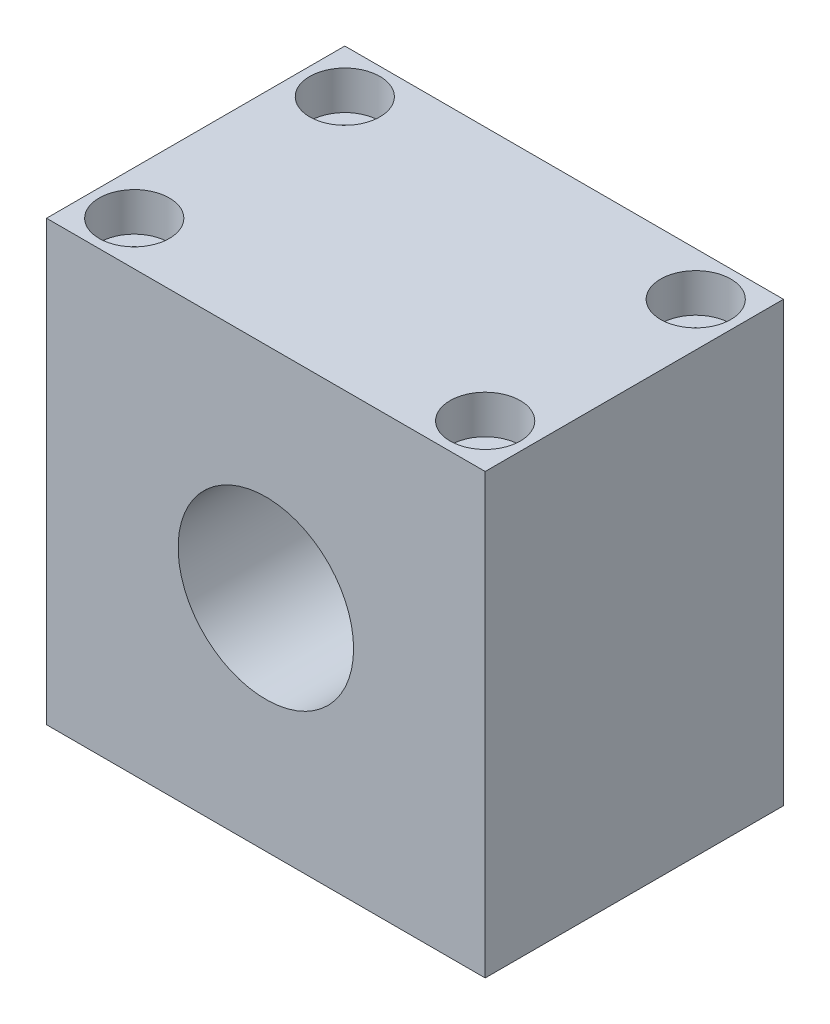
ISO-10303-21;
HEADER;
FILE_DESCRIPTION(('STEP AP214'),'2;1');
FILE_NAME('part.step','',(''),(''),'','','');
FILE_SCHEMA(('AUTOMOTIVE_DESIGN { 1 0 10303 214 1 1 1 1 }'));
ENDSEC;
DATA;
#1=APPLICATION_CONTEXT('core data for automotive mechanical design processes');
#2=APPLICATION_PROTOCOL_DEFINITION('international standard','automotive_design',2000,#1);
#3=PRODUCT_CONTEXT('',#1,'mechanical');
#4=PRODUCT('Part','Part','',(#3));
#5=PRODUCT_RELATED_PRODUCT_CATEGORY('part','',(#4));
#6=PRODUCT_DEFINITION_FORMATION('','',#4);
#7=PRODUCT_DEFINITION_CONTEXT('part definition',#1,'design');
#8=PRODUCT_DEFINITION('design','',#6,#7);
#9=PRODUCT_DEFINITION_SHAPE('','',#8);
#10=(LENGTH_UNIT() NAMED_UNIT(*) SI_UNIT(.MILLI.,.METRE.));
#11=(NAMED_UNIT(*) PLANE_ANGLE_UNIT() SI_UNIT($,.RADIAN.));
#12=(NAMED_UNIT(*) SI_UNIT($,.STERADIAN.) SOLID_ANGLE_UNIT());
#13=UNCERTAINTY_MEASURE_WITH_UNIT(LENGTH_MEASURE(1.E-05),#10,'distance_accuracy_value','');
#14=(GEOMETRIC_REPRESENTATION_CONTEXT(3) GLOBAL_UNCERTAINTY_ASSIGNED_CONTEXT((#13)) GLOBAL_UNIT_ASSIGNED_CONTEXT((#10,
#11,#12)) REPRESENTATION_CONTEXT('',''));
#15=CARTESIAN_POINT('',(0.,0.,0.));
#16=DIRECTION('',(0.,0.,1.));
#17=DIRECTION('',(1.,0.,0.));
#18=AXIS2_PLACEMENT_3D('',#15,#16,#17);
#19=CARTESIAN_POINT('',(25.,-25.,34.));
#20=DIRECTION('',(-1.,0.,0.));
#21=DIRECTION('',(0.,0.,1.));
#22=AXIS2_PLACEMENT_3D('',#19,#20,#21);
#23=PLANE('',#22);
#24=DIRECTION('',(0.,1.,0.));
#25=VECTOR('',#24,1.);
#26=CARTESIAN_POINT('',(25.,-25.,0.));
#27=LINE('',#26,#25);
#28=CARTESIAN_POINT('',(25.,-25.,0.));
#29=VERTEX_POINT('',#28);
#30=CARTESIAN_POINT('',(25.,25.,0.));
#31=VERTEX_POINT('',#30);
#32=EDGE_CURVE('E100',#29,#31,#27,.T.);
#33=ORIENTED_EDGE('',*,*,#32,.T.);
#34=DIRECTION('',(0.,0.,-1.));
#35=VECTOR('',#34,1.);
#36=CARTESIAN_POINT('',(25.,25.,34.));
#37=LINE('',#36,#35);
#38=CARTESIAN_POINT('',(25.,25.,34.));
#39=VERTEX_POINT('',#38);
#40=EDGE_CURVE('E11',#39,#31,#37,.T.);
#41=ORIENTED_EDGE('',*,*,#40,.F.);
#42=DIRECTION('',(0.,1.,0.));
#43=VECTOR('',#42,1.);
#44=CARTESIAN_POINT('',(25.,-25.,34.));
#45=LINE('',#44,#43);
#46=CARTESIAN_POINT('',(25.,-25.,34.));
#47=VERTEX_POINT('',#46);
#48=EDGE_CURVE('E88',#47,#39,#45,.T.);
#49=ORIENTED_EDGE('',*,*,#48,.F.);
#50=DIRECTION('',(0.,0.,-1.));
#51=VECTOR('',#50,1.);
#52=CARTESIAN_POINT('',(25.,-25.,34.));
#53=LINE('',#52,#51);
#54=EDGE_CURVE('E96',#47,#29,#53,.T.);
#55=ORIENTED_EDGE('',*,*,#54,.T.);
#56=EDGE_LOOP('',(#33,#41,#49,#55));
#57=FACE_BOUND('',#56,.T.);
#58=ADVANCED_FACE('F37',(#57),#23,.F.);
#59=CARTESIAN_POINT('',(-25.,25.,34.));
#60=DIRECTION('',(0.,-1.,0.));
#61=DIRECTION('',(0.,0.,-1.));
#62=AXIS2_PLACEMENT_3D('',#59,#60,#61);
#63=PLANE('',#62);
#64=CARTESIAN_POINT('',(-20.,25.,5.));
#65=DIRECTION('',(0.,1.,0.));
#66=DIRECTION('',(0.,0.,1.));
#67=AXIS2_PLACEMENT_3D('',#64,#65,#66);
#68=CIRCLE('',#67,3.99999999999999);
#69=CARTESIAN_POINT('',(-20.,25.,8.99999999999999));
#70=VERTEX_POINT('',#69);
#71=EDGE_CURVE('E158',#70,#70,#68,.T.);
#72=ORIENTED_EDGE('',*,*,#71,.F.);
#73=EDGE_LOOP('',(#72));
#74=FACE_BOUND('',#73,.T.);
#75=CARTESIAN_POINT('',(20.,25.,5.));
#76=DIRECTION('',(0.,1.,0.));
#77=DIRECTION('',(0.,0.,1.));
#78=AXIS2_PLACEMENT_3D('',#75,#76,#77);
#79=CIRCLE('',#78,3.99999999999999);
#80=CARTESIAN_POINT('',(20.,25.,8.99999999999999));
#81=VERTEX_POINT('',#80);
#82=EDGE_CURVE('E146',#81,#81,#79,.T.);
#83=ORIENTED_EDGE('',*,*,#82,.F.);
#84=EDGE_LOOP('',(#83));
#85=FACE_BOUND('',#84,.T.);
#86=CARTESIAN_POINT('',(20.,25.,29.));
#87=DIRECTION('',(0.,1.,0.));
#88=DIRECTION('',(0.,0.,1.));
#89=AXIS2_PLACEMENT_3D('',#86,#87,#88);
#90=CIRCLE('',#89,3.99999999999999);
#91=CARTESIAN_POINT('',(20.,25.,33.));
#92=VERTEX_POINT('',#91);
#93=EDGE_CURVE('E134',#92,#92,#90,.T.);
#94=ORIENTED_EDGE('',*,*,#93,.F.);
#95=EDGE_LOOP('',(#94));
#96=FACE_BOUND('',#95,.T.);
#97=CARTESIAN_POINT('',(-20.,25.,29.));
#98=DIRECTION('',(0.,1.,0.));
#99=DIRECTION('',(0.,0.,1.));
#100=AXIS2_PLACEMENT_3D('',#97,#98,#99);
#101=CIRCLE('',#100,3.99999999999999);
#102=CARTESIAN_POINT('',(-20.,25.,33.));
#103=VERTEX_POINT('',#102);
#104=EDGE_CURVE('E122',#103,#103,#101,.T.);
#105=ORIENTED_EDGE('',*,*,#104,.F.);
#106=EDGE_LOOP('',(#105));
#107=FACE_BOUND('',#106,.T.);
#108=DIRECTION('',(-1.,0.,0.));
#109=VECTOR('',#108,1.);
#110=CARTESIAN_POINT('',(-25.,25.,0.));
#111=LINE('',#110,#109);
#112=CARTESIAN_POINT('',(-25.,25.,0.));
#113=VERTEX_POINT('',#112);
#114=EDGE_CURVE('E92',#31,#113,#111,.T.);
#115=ORIENTED_EDGE('',*,*,#114,.T.);
#116=DIRECTION('',(0.,0.,-1.));
#117=VECTOR('',#116,1.);
#118=CARTESIAN_POINT('',(-25.,25.,34.));
#119=LINE('',#118,#117);
#120=CARTESIAN_POINT('',(-25.,25.,34.));
#121=VERTEX_POINT('',#120);
#122=EDGE_CURVE('E45',#121,#113,#119,.T.);
#123=ORIENTED_EDGE('',*,*,#122,.F.);
#124=DIRECTION('',(-1.,0.,0.));
#125=VECTOR('',#124,1.);
#126=CARTESIAN_POINT('',(-25.,25.,34.));
#127=LINE('',#126,#125);
#128=EDGE_CURVE('E83',#39,#121,#127,.T.);
#129=ORIENTED_EDGE('',*,*,#128,.F.);
#130=ORIENTED_EDGE('',*,*,#40,.T.);
#131=EDGE_LOOP('',(#115,#123,#129,#130));
#132=FACE_BOUND('',#131,.T.);
#133=ADVANCED_FACE('F91',(#74,#85,#96,#107,#132),#63,.F.);
#134=CARTESIAN_POINT('',(-25.,-25.,34.));
#135=DIRECTION('',(1.,0.,0.));
#136=DIRECTION('',(0.,0.,-1.));
#137=AXIS2_PLACEMENT_3D('',#134,#135,#136);
#138=PLANE('',#137);
#139=DIRECTION('',(0.,-1.,0.));
#140=VECTOR('',#139,1.);
#141=CARTESIAN_POINT('',(-25.,-25.,0.));
#142=LINE('',#141,#140);
#143=CARTESIAN_POINT('',(-25.,-25.,0.));
#144=VERTEX_POINT('',#143);
#145=EDGE_CURVE('E70',#113,#144,#142,.T.);
#146=ORIENTED_EDGE('',*,*,#145,.T.);
#147=DIRECTION('',(0.,0.,-1.));
#148=VECTOR('',#147,1.);
#149=CARTESIAN_POINT('',(-25.,-25.,34.));
#150=LINE('',#149,#148);
#151=CARTESIAN_POINT('',(-25.,-25.,34.));
#152=VERTEX_POINT('',#151);
#153=EDGE_CURVE('E93',#152,#144,#150,.T.);
#154=ORIENTED_EDGE('',*,*,#153,.F.);
#155=DIRECTION('',(0.,-1.,0.));
#156=VECTOR('',#155,1.);
#157=CARTESIAN_POINT('',(-25.,-25.,34.));
#158=LINE('',#157,#156);
#159=EDGE_CURVE('E86',#121,#152,#158,.T.);
#160=ORIENTED_EDGE('',*,*,#159,.F.);
#161=ORIENTED_EDGE('',*,*,#122,.T.);
#162=EDGE_LOOP('',(#146,#154,#160,#161));
#163=FACE_BOUND('',#162,.T.);
#164=ADVANCED_FACE('F94',(#163),#138,.F.);
#165=CARTESIAN_POINT('',(-25.,-25.,34.));
#166=DIRECTION('',(0.,1.,0.));
#167=DIRECTION('',(0.,0.,1.));
#168=AXIS2_PLACEMENT_3D('',#165,#166,#167);
#169=PLANE('',#168);
#170=CARTESIAN_POINT('',(-20.,-25.,5.));
#171=DIRECTION('',(0.,1.,0.));
#172=DIRECTION('',(0.,0.,1.));
#173=AXIS2_PLACEMENT_3D('',#170,#171,#172);
#174=CIRCLE('',#173,2.24999999999999);
#175=CARTESIAN_POINT('',(-20.,-25.,7.24999999999999));
#176=VERTEX_POINT('',#175);
#177=EDGE_CURVE('E149',#176,#176,#174,.T.);
#178=ORIENTED_EDGE('',*,*,#177,.T.);
#179=EDGE_LOOP('',(#178));
#180=FACE_BOUND('',#179,.T.);
#181=CARTESIAN_POINT('',(20.,-25.,5.));
#182=DIRECTION('',(0.,1.,0.));
#183=DIRECTION('',(0.,0.,1.));
#184=AXIS2_PLACEMENT_3D('',#181,#182,#183);
#185=CIRCLE('',#184,2.24999999999999);
#186=CARTESIAN_POINT('',(20.,-25.,7.24999999999999));
#187=VERTEX_POINT('',#186);
#188=EDGE_CURVE('E137',#187,#187,#185,.T.);
#189=ORIENTED_EDGE('',*,*,#188,.T.);
#190=EDGE_LOOP('',(#189));
#191=FACE_BOUND('',#190,.T.);
#192=CARTESIAN_POINT('',(20.,-25.,29.));
#193=DIRECTION('',(0.,1.,0.));
#194=DIRECTION('',(0.,0.,1.));
#195=AXIS2_PLACEMENT_3D('',#192,#193,#194);
#196=CIRCLE('',#195,2.24999999999999);
#197=CARTESIAN_POINT('',(20.,-25.,31.25));
#198=VERTEX_POINT('',#197);
#199=EDGE_CURVE('E125',#198,#198,#196,.T.);
#200=ORIENTED_EDGE('',*,*,#199,.T.);
#201=EDGE_LOOP('',(#200));
#202=FACE_BOUND('',#201,.T.);
#203=CARTESIAN_POINT('',(-20.,-25.,29.));
#204=DIRECTION('',(0.,1.,0.));
#205=DIRECTION('',(0.,0.,1.));
#206=AXIS2_PLACEMENT_3D('',#203,#204,#205);
#207=CIRCLE('',#206,2.24999999999999);
#208=CARTESIAN_POINT('',(-20.,-25.,31.25));
#209=VERTEX_POINT('',#208);
#210=EDGE_CURVE('E103',#209,#209,#207,.T.);
#211=ORIENTED_EDGE('',*,*,#210,.T.);
#212=EDGE_LOOP('',(#211));
#213=FACE_BOUND('',#212,.T.);
#214=DIRECTION('',(1.,0.,0.));
#215=VECTOR('',#214,1.);
#216=CARTESIAN_POINT('',(-25.,-25.,0.));
#217=LINE('',#216,#215);
#218=EDGE_CURVE('E76',#144,#29,#217,.T.);
#219=ORIENTED_EDGE('',*,*,#218,.T.);
#220=ORIENTED_EDGE('',*,*,#54,.F.);
#221=DIRECTION('',(1.,0.,0.));
#222=VECTOR('',#221,1.);
#223=CARTESIAN_POINT('',(-25.,-25.,34.));
#224=LINE('',#223,#222);
#225=EDGE_CURVE('E53',#152,#47,#224,.T.);
#226=ORIENTED_EDGE('',*,*,#225,.F.);
#227=ORIENTED_EDGE('',*,*,#153,.T.);
#228=EDGE_LOOP('',(#219,#220,#226,#227));
#229=FACE_BOUND('',#228,.T.);
#230=ADVANCED_FACE('F108',(#180,#191,#202,#213,#229),#169,.F.);
#231=CARTESIAN_POINT('',(0.,0.,34.));
#232=DIRECTION('',(0.,0.,-1.));
#233=DIRECTION('',(-1.,0.,0.));
#234=AXIS2_PLACEMENT_3D('',#231,#232,#233);
#235=PLANE('',#234);
#236=CARTESIAN_POINT('',(0.,0.,34.));
#237=DIRECTION('',(0.,0.,1.));
#238=DIRECTION('',(1.,0.,0.));
#239=AXIS2_PLACEMENT_3D('',#236,#237,#238);
#240=CIRCLE('',#239,10.);
#241=CARTESIAN_POINT('',(10.,0.,34.));
#242=VERTEX_POINT('',#241);
#243=EDGE_CURVE('E162',#242,#242,#240,.T.);
#244=ORIENTED_EDGE('',*,*,#243,.F.);
#245=EDGE_LOOP('',(#244));
#246=FACE_BOUND('',#245,.T.);
#247=ORIENTED_EDGE('',*,*,#48,.T.);
#248=ORIENTED_EDGE('',*,*,#128,.T.);
#249=ORIENTED_EDGE('',*,*,#159,.T.);
#250=ORIENTED_EDGE('',*,*,#225,.T.);
#251=EDGE_LOOP('',(#247,#248,#249,#250));
#252=FACE_BOUND('',#251,.T.);
#253=ADVANCED_FACE('F84',(#246,#252),#235,.F.);
#254=CARTESIAN_POINT('',(0.,0.,0.));
#255=DIRECTION('',(0.,0.,-1.));
#256=DIRECTION('',(-1.,0.,0.));
#257=AXIS2_PLACEMENT_3D('',#254,#255,#256);
#258=PLANE('',#257);
#259=CARTESIAN_POINT('',(0.,0.,0.));
#260=DIRECTION('',(0.,0.,1.));
#261=DIRECTION('',(1.,0.,0.));
#262=AXIS2_PLACEMENT_3D('',#259,#260,#261);
#263=CIRCLE('',#262,10.);
#264=CARTESIAN_POINT('',(10.,0.,0.));
#265=VERTEX_POINT('',#264);
#266=EDGE_CURVE('E161',#265,#265,#263,.T.);
#267=ORIENTED_EDGE('',*,*,#266,.T.);
#268=EDGE_LOOP('',(#267));
#269=FACE_BOUND('',#268,.T.);
#270=ORIENTED_EDGE('',*,*,#32,.F.);
#271=ORIENTED_EDGE('',*,*,#218,.F.);
#272=ORIENTED_EDGE('',*,*,#145,.F.);
#273=ORIENTED_EDGE('',*,*,#114,.F.);
#274=EDGE_LOOP('',(#270,#271,#272,#273));
#275=FACE_BOUND('',#274,.T.);
#276=ADVANCED_FACE('F111',(#269,#275),#258,.T.);
#277=CARTESIAN_POINT('',(-20.,25.,29.));
#278=DIRECTION('',(0.,1.,0.));
#279=DIRECTION('',(0.,0.,1.));
#280=AXIS2_PLACEMENT_3D('',#277,#278,#279);
#281=CYLINDRICAL_SURFACE('',#280,2.25);
#282=ORIENTED_EDGE('',*,*,#210,.F.);
#283=EDGE_LOOP('',(#282));
#284=FACE_BOUND('',#283,.T.);
#285=CARTESIAN_POINT('',(-20.,20.6,29.));
#286=DIRECTION('',(0.,1.,0.));
#287=DIRECTION('',(0.,0.,1.));
#288=AXIS2_PLACEMENT_3D('',#285,#286,#287);
#289=CIRCLE('',#288,2.25000000000001);
#290=CARTESIAN_POINT('',(-20.,20.6,31.25));
#291=VERTEX_POINT('',#290);
#292=EDGE_CURVE('E116',#291,#291,#289,.T.);
#293=ORIENTED_EDGE('',*,*,#292,.T.);
#294=EDGE_LOOP('',(#293));
#295=FACE_BOUND('',#294,.T.);
#296=ADVANCED_FACE('F182',(#284,#295),#281,.F.);
#297=CARTESIAN_POINT('',(-17.75,20.6,29.));
#298=DIRECTION('',(0.,-1.,0.));
#299=DIRECTION('',(0.,0.,-1.));
#300=AXIS2_PLACEMENT_3D('',#297,#298,#299);
#301=PLANE('',#300);
#302=ORIENTED_EDGE('',*,*,#292,.F.);
#303=EDGE_LOOP('',(#302));
#304=FACE_BOUND('',#303,.T.);
#305=CARTESIAN_POINT('',(-20.,20.6,29.));
#306=DIRECTION('',(0.,1.,0.));
#307=DIRECTION('',(0.,0.,1.));
#308=AXIS2_PLACEMENT_3D('',#305,#306,#307);
#309=CIRCLE('',#308,4.);
#310=CARTESIAN_POINT('',(-20.,20.6,33.));
#311=VERTEX_POINT('',#310);
#312=EDGE_CURVE('E119',#311,#311,#309,.T.);
#313=ORIENTED_EDGE('',*,*,#312,.T.);
#314=EDGE_LOOP('',(#313));
#315=FACE_BOUND('',#314,.T.);
#316=ADVANCED_FACE('F207',(#304,#315),#301,.F.);
#317=CARTESIAN_POINT('',(-20.,25.,29.));
#318=DIRECTION('',(0.,1.,0.));
#319=DIRECTION('',(0.,0.,1.));
#320=AXIS2_PLACEMENT_3D('',#317,#318,#319);
#321=CYLINDRICAL_SURFACE('',#320,3.99999999999999);
#322=ORIENTED_EDGE('',*,*,#312,.F.);
#323=EDGE_LOOP('',(#322));
#324=FACE_BOUND('',#323,.T.);
#325=ORIENTED_EDGE('',*,*,#104,.T.);
#326=EDGE_LOOP('',(#325));
#327=FACE_BOUND('',#326,.T.);
#328=ADVANCED_FACE('F204',(#324,#327),#321,.F.);
#329=CARTESIAN_POINT('',(20.,25.,29.));
#330=DIRECTION('',(0.,1.,0.));
#331=DIRECTION('',(0.,0.,1.));
#332=AXIS2_PLACEMENT_3D('',#329,#330,#331);
#333=CYLINDRICAL_SURFACE('',#332,2.25);
#334=ORIENTED_EDGE('',*,*,#199,.F.);
#335=EDGE_LOOP('',(#334));
#336=FACE_BOUND('',#335,.T.);
#337=CARTESIAN_POINT('',(20.,20.6,29.));
#338=DIRECTION('',(0.,1.,0.));
#339=DIRECTION('',(0.,0.,1.));
#340=AXIS2_PLACEMENT_3D('',#337,#338,#339);
#341=CIRCLE('',#340,2.25000000000001);
#342=CARTESIAN_POINT('',(20.,20.6,31.25));
#343=VERTEX_POINT('',#342);
#344=EDGE_CURVE('E128',#343,#343,#341,.T.);
#345=ORIENTED_EDGE('',*,*,#344,.T.);
#346=EDGE_LOOP('',(#345));
#347=FACE_BOUND('',#346,.T.);
#348=ADVANCED_FACE('F206',(#336,#347),#333,.F.);
#349=CARTESIAN_POINT('',(22.25,20.6,29.));
#350=DIRECTION('',(0.,-1.,0.));
#351=DIRECTION('',(0.,0.,-1.));
#352=AXIS2_PLACEMENT_3D('',#349,#350,#351);
#353=PLANE('',#352);
#354=ORIENTED_EDGE('',*,*,#344,.F.);
#355=EDGE_LOOP('',(#354));
#356=FACE_BOUND('',#355,.T.);
#357=CARTESIAN_POINT('',(20.,20.6,29.));
#358=DIRECTION('',(0.,1.,0.));
#359=DIRECTION('',(0.,0.,1.));
#360=AXIS2_PLACEMENT_3D('',#357,#358,#359);
#361=CIRCLE('',#360,4.);
#362=CARTESIAN_POINT('',(20.,20.6,33.));
#363=VERTEX_POINT('',#362);
#364=EDGE_CURVE('E131',#363,#363,#361,.T.);
#365=ORIENTED_EDGE('',*,*,#364,.T.);
#366=EDGE_LOOP('',(#365));
#367=FACE_BOUND('',#366,.T.);
#368=ADVANCED_FACE('F214',(#356,#367),#353,.F.);
#369=CARTESIAN_POINT('',(20.,25.,29.));
#370=DIRECTION('',(0.,1.,0.));
#371=DIRECTION('',(0.,0.,1.));
#372=AXIS2_PLACEMENT_3D('',#369,#370,#371);
#373=CYLINDRICAL_SURFACE('',#372,3.99999999999999);
#374=ORIENTED_EDGE('',*,*,#364,.F.);
#375=EDGE_LOOP('',(#374));
#376=FACE_BOUND('',#375,.T.);
#377=ORIENTED_EDGE('',*,*,#93,.T.);
#378=EDGE_LOOP('',(#377));
#379=FACE_BOUND('',#378,.T.);
#380=ADVANCED_FACE('F256',(#376,#379),#373,.F.);
#381=CARTESIAN_POINT('',(20.,25.,5.));
#382=DIRECTION('',(0.,1.,0.));
#383=DIRECTION('',(0.,0.,1.));
#384=AXIS2_PLACEMENT_3D('',#381,#382,#383);
#385=CYLINDRICAL_SURFACE('',#384,2.25);
#386=ORIENTED_EDGE('',*,*,#188,.F.);
#387=EDGE_LOOP('',(#386));
#388=FACE_BOUND('',#387,.T.);
#389=CARTESIAN_POINT('',(20.,20.6,5.));
#390=DIRECTION('',(0.,1.,0.));
#391=DIRECTION('',(0.,0.,1.));
#392=AXIS2_PLACEMENT_3D('',#389,#390,#391);
#393=CIRCLE('',#392,2.25000000000001);
#394=CARTESIAN_POINT('',(20.,20.6,7.25000000000001));
#395=VERTEX_POINT('',#394);
#396=EDGE_CURVE('E140',#395,#395,#393,.T.);
#397=ORIENTED_EDGE('',*,*,#396,.T.);
#398=EDGE_LOOP('',(#397));
#399=FACE_BOUND('',#398,.T.);
#400=ADVANCED_FACE('F265',(#388,#399),#385,.F.);
#401=CARTESIAN_POINT('',(22.25,20.6,5.));
#402=DIRECTION('',(0.,-1.,0.));
#403=DIRECTION('',(0.,0.,-1.));
#404=AXIS2_PLACEMENT_3D('',#401,#402,#403);
#405=PLANE('',#404);
#406=ORIENTED_EDGE('',*,*,#396,.F.);
#407=EDGE_LOOP('',(#406));
#408=FACE_BOUND('',#407,.T.);
#409=CARTESIAN_POINT('',(20.,20.6,5.));
#410=DIRECTION('',(0.,1.,0.));
#411=DIRECTION('',(0.,0.,1.));
#412=AXIS2_PLACEMENT_3D('',#409,#410,#411);
#413=CIRCLE('',#412,4.);
#414=CARTESIAN_POINT('',(20.,20.6,9.));
#415=VERTEX_POINT('',#414);
#416=EDGE_CURVE('E143',#415,#415,#413,.T.);
#417=ORIENTED_EDGE('',*,*,#416,.T.);
#418=EDGE_LOOP('',(#417));
#419=FACE_BOUND('',#418,.T.);
#420=ADVANCED_FACE('F275',(#408,#419),#405,.F.);
#421=CARTESIAN_POINT('',(20.,25.,5.));
#422=DIRECTION('',(0.,1.,0.));
#423=DIRECTION('',(0.,0.,1.));
#424=AXIS2_PLACEMENT_3D('',#421,#422,#423);
#425=CYLINDRICAL_SURFACE('',#424,3.99999999999999);
#426=ORIENTED_EDGE('',*,*,#416,.F.);
#427=EDGE_LOOP('',(#426));
#428=FACE_BOUND('',#427,.T.);
#429=ORIENTED_EDGE('',*,*,#82,.T.);
#430=EDGE_LOOP('',(#429));
#431=FACE_BOUND('',#430,.T.);
#432=ADVANCED_FACE('F285',(#428,#431),#425,.F.);
#433=CARTESIAN_POINT('',(-20.,25.,5.));
#434=DIRECTION('',(0.,1.,0.));
#435=DIRECTION('',(0.,0.,1.));
#436=AXIS2_PLACEMENT_3D('',#433,#434,#435);
#437=CYLINDRICAL_SURFACE('',#436,2.25);
#438=ORIENTED_EDGE('',*,*,#177,.F.);
#439=EDGE_LOOP('',(#438));
#440=FACE_BOUND('',#439,.T.);
#441=CARTESIAN_POINT('',(-20.,20.6,5.));
#442=DIRECTION('',(0.,1.,0.));
#443=DIRECTION('',(0.,0.,1.));
#444=AXIS2_PLACEMENT_3D('',#441,#442,#443);
#445=CIRCLE('',#444,2.25000000000001);
#446=CARTESIAN_POINT('',(-20.,20.6,7.25000000000001));
#447=VERTEX_POINT('',#446);
#448=EDGE_CURVE('E152',#447,#447,#445,.T.);
#449=ORIENTED_EDGE('',*,*,#448,.T.);
#450=EDGE_LOOP('',(#449));
#451=FACE_BOUND('',#450,.T.);
#452=ADVANCED_FACE('F295',(#440,#451),#437,.F.);
#453=CARTESIAN_POINT('',(-17.75,20.6,5.));
#454=DIRECTION('',(0.,-1.,0.));
#455=DIRECTION('',(0.,0.,-1.));
#456=AXIS2_PLACEMENT_3D('',#453,#454,#455);
#457=PLANE('',#456);
#458=ORIENTED_EDGE('',*,*,#448,.F.);
#459=EDGE_LOOP('',(#458));
#460=FACE_BOUND('',#459,.T.);
#461=CARTESIAN_POINT('',(-20.,20.6,5.));
#462=DIRECTION('',(0.,1.,0.));
#463=DIRECTION('',(0.,0.,1.));
#464=AXIS2_PLACEMENT_3D('',#461,#462,#463);
#465=CIRCLE('',#464,4.);
#466=CARTESIAN_POINT('',(-20.,20.6,9.));
#467=VERTEX_POINT('',#466);
#468=EDGE_CURVE('E155',#467,#467,#465,.T.);
#469=ORIENTED_EDGE('',*,*,#468,.T.);
#470=EDGE_LOOP('',(#469));
#471=FACE_BOUND('',#470,.T.);
#472=ADVANCED_FACE('F305',(#460,#471),#457,.F.);
#473=CARTESIAN_POINT('',(-20.,25.,5.));
#474=DIRECTION('',(0.,1.,0.));
#475=DIRECTION('',(0.,0.,1.));
#476=AXIS2_PLACEMENT_3D('',#473,#474,#475);
#477=CYLINDRICAL_SURFACE('',#476,3.99999999999999);
#478=ORIENTED_EDGE('',*,*,#468,.F.);
#479=EDGE_LOOP('',(#478));
#480=FACE_BOUND('',#479,.T.);
#481=ORIENTED_EDGE('',*,*,#71,.T.);
#482=EDGE_LOOP('',(#481));
#483=FACE_BOUND('',#482,.T.);
#484=ADVANCED_FACE('F172',(#480,#483),#477,.F.);
#485=CARTESIAN_POINT('',(0.,0.,0.));
#486=DIRECTION('',(0.,0.,1.));
#487=DIRECTION('',(1.,0.,0.));
#488=AXIS2_PLACEMENT_3D('',#485,#486,#487);
#489=CYLINDRICAL_SURFACE('',#488,10.);
#490=ORIENTED_EDGE('',*,*,#266,.F.);
#491=EDGE_LOOP('',(#490));
#492=FACE_BOUND('',#491,.T.);
#493=ORIENTED_EDGE('',*,*,#243,.T.);
#494=EDGE_LOOP('',(#493));
#495=FACE_BOUND('',#494,.T.);
#496=ADVANCED_FACE('F169',(#492,#495),#489,.F.);
#497=CLOSED_SHELL('',(#58,#133,#164,#230,#253,#276,#296,#316,#328,#348,#368,#380,#400,#420,#432,
#452,#472,#484,#496));
#498=MANIFOLD_SOLID_BREP('B2',#497);
#499=ADVANCED_BREP_SHAPE_REPRESENTATION('',(#18,#498),#14);
#500=SHAPE_DEFINITION_REPRESENTATION(#9,#499);
ENDSEC;
END-ISO-10303-21;
